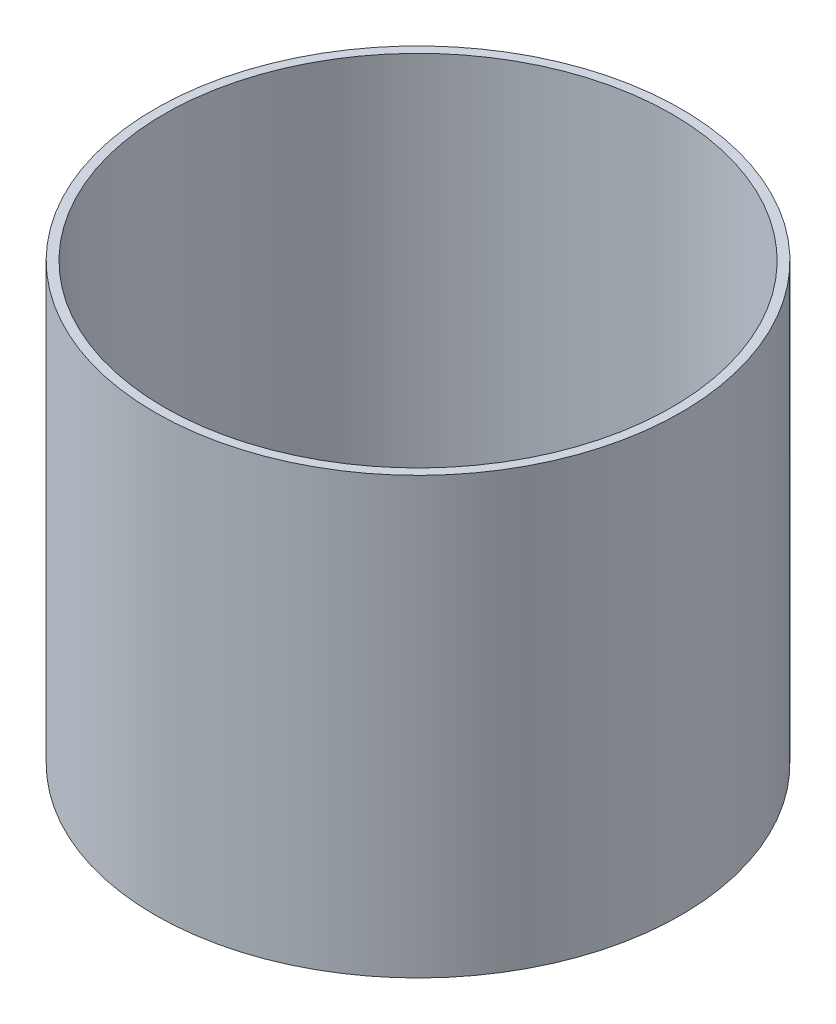
ISO-10303-21;
HEADER;
FILE_DESCRIPTION(('STEP AP214'),'2;1');
FILE_NAME('part.step','',(''),(''),'','','');
FILE_SCHEMA(('AUTOMOTIVE_DESIGN { 1 0 10303 214 1 1 1 1 }'));
ENDSEC;
DATA;
#1=APPLICATION_CONTEXT('core data for automotive mechanical design processes');
#2=APPLICATION_PROTOCOL_DEFINITION('international standard','automotive_design',2000,#1);
#3=PRODUCT_CONTEXT('',#1,'mechanical');
#4=PRODUCT('Part','Part','',(#3));
#5=PRODUCT_RELATED_PRODUCT_CATEGORY('part','',(#4));
#6=PRODUCT_DEFINITION_FORMATION('','',#4);
#7=PRODUCT_DEFINITION_CONTEXT('part definition',#1,'design');
#8=PRODUCT_DEFINITION('design','',#6,#7);
#9=PRODUCT_DEFINITION_SHAPE('','',#8);
#10=(LENGTH_UNIT() NAMED_UNIT(*) SI_UNIT(.MILLI.,.METRE.));
#11=(NAMED_UNIT(*) PLANE_ANGLE_UNIT() SI_UNIT($,.RADIAN.));
#12=(NAMED_UNIT(*) SI_UNIT($,.STERADIAN.) SOLID_ANGLE_UNIT());
#13=UNCERTAINTY_MEASURE_WITH_UNIT(LENGTH_MEASURE(1.E-05),#10,'distance_accuracy_value','');
#14=(GEOMETRIC_REPRESENTATION_CONTEXT(3) GLOBAL_UNCERTAINTY_ASSIGNED_CONTEXT((#13)) GLOBAL_UNIT_ASSIGNED_CONTEXT((#10,
#11,#12)) REPRESENTATION_CONTEXT('',''));
#15=CARTESIAN_POINT('',(0.,0.,0.));
#16=DIRECTION('',(0.,0.,1.));
#17=DIRECTION('',(1.,0.,0.));
#18=AXIS2_PLACEMENT_3D('',#15,#16,#17);
#19=CARTESIAN_POINT('',(0.,152.4,0.));
#20=DIRECTION('',(0.,1.,0.));
#21=DIRECTION('',(0.,0.,1.));
#22=AXIS2_PLACEMENT_3D('',#19,#20,#21);
#23=PLANE('',#22);
#24=CARTESIAN_POINT('',(0.,152.4,0.));
#25=DIRECTION('',(0.,1.,0.));
#26=DIRECTION('',(0.,0.,1.));
#27=AXIS2_PLACEMENT_3D('',#24,#25,#26);
#28=CIRCLE('',#27,92.075);
#29=CARTESIAN_POINT('',(0.,152.4,92.075));
#30=VERTEX_POINT('',#29);
#31=EDGE_CURVE('E10',#30,#30,#28,.T.);
#32=ORIENTED_EDGE('',*,*,#31,.T.);
#33=EDGE_LOOP('',(#32));
#34=FACE_BOUND('',#33,.T.);
#35=CARTESIAN_POINT('',(0.,152.4,0.));
#36=DIRECTION('',(0.,1.,0.));
#37=DIRECTION('',(0.,0.,1.));
#38=AXIS2_PLACEMENT_3D('',#35,#36,#37);
#39=CIRCLE('',#38,88.9);
#40=CARTESIAN_POINT('',(0.,152.4,88.9));
#41=VERTEX_POINT('',#40);
#42=EDGE_CURVE('E44',#41,#41,#39,.T.);
#43=ORIENTED_EDGE('',*,*,#42,.F.);
#44=EDGE_LOOP('',(#43));
#45=FACE_BOUND('',#44,.T.);
#46=ADVANCED_FACE('F33',(#34,#45),#23,.T.);
#47=CARTESIAN_POINT('',(0.,0.,0.));
#48=DIRECTION('',(0.,1.,0.));
#49=DIRECTION('',(0.,0.,1.));
#50=AXIS2_PLACEMENT_3D('',#47,#48,#49);
#51=PLANE('',#50);
#52=CARTESIAN_POINT('',(0.,0.,0.));
#53=DIRECTION('',(0.,1.,0.));
#54=DIRECTION('',(0.,0.,1.));
#55=AXIS2_PLACEMENT_3D('',#52,#53,#54);
#56=CIRCLE('',#55,92.075);
#57=CARTESIAN_POINT('',(0.,0.,92.075));
#58=VERTEX_POINT('',#57);
#59=EDGE_CURVE('E37',#58,#58,#56,.T.);
#60=ORIENTED_EDGE('',*,*,#59,.F.);
#61=EDGE_LOOP('',(#60));
#62=FACE_BOUND('',#61,.T.);
#63=CARTESIAN_POINT('',(0.,0.,0.));
#64=DIRECTION('',(0.,1.,0.));
#65=DIRECTION('',(0.,0.,1.));
#66=AXIS2_PLACEMENT_3D('',#63,#64,#65);
#67=CIRCLE('',#66,88.9);
#68=CARTESIAN_POINT('',(0.,0.,88.9));
#69=VERTEX_POINT('',#68);
#70=EDGE_CURVE('E46',#69,#69,#67,.T.);
#71=ORIENTED_EDGE('',*,*,#70,.T.);
#72=EDGE_LOOP('',(#71));
#73=FACE_BOUND('',#72,.T.);
#74=ADVANCED_FACE('F56',(#62,#73),#51,.F.);
#75=CARTESIAN_POINT('',(0.,152.4,0.));
#76=DIRECTION('',(0.,-1.,0.));
#77=DIRECTION('',(0.,0.,-1.));
#78=AXIS2_PLACEMENT_3D('',#75,#76,#77);
#79=CYLINDRICAL_SURFACE('',#78,92.075);
#80=ORIENTED_EDGE('',*,*,#31,.F.);
#81=EDGE_LOOP('',(#80));
#82=FACE_BOUND('',#81,.T.);
#83=ORIENTED_EDGE('',*,*,#59,.T.);
#84=EDGE_LOOP('',(#83));
#85=FACE_BOUND('',#84,.T.);
#86=ADVANCED_FACE('F35',(#82,#85),#79,.T.);
#87=CARTESIAN_POINT('',(0.,152.4,0.));
#88=DIRECTION('',(0.,-1.,0.));
#89=DIRECTION('',(0.,0.,-1.));
#90=AXIS2_PLACEMENT_3D('',#87,#88,#89);
#91=CYLINDRICAL_SURFACE('',#90,88.9);
#92=ORIENTED_EDGE('',*,*,#42,.T.);
#93=EDGE_LOOP('',(#92));
#94=FACE_BOUND('',#93,.T.);
#95=ORIENTED_EDGE('',*,*,#70,.F.);
#96=EDGE_LOOP('',(#95));
#97=FACE_BOUND('',#96,.T.);
#98=ADVANCED_FACE('F52',(#94,#97),#91,.F.);
#99=CLOSED_SHELL('',(#46,#74,#86,#98));
#100=MANIFOLD_SOLID_BREP('B2',#99);
#101=ADVANCED_BREP_SHAPE_REPRESENTATION('',(#18,#100),#14);
#102=SHAPE_DEFINITION_REPRESENTATION(#9,#101);
ENDSEC;
END-ISO-10303-21;
